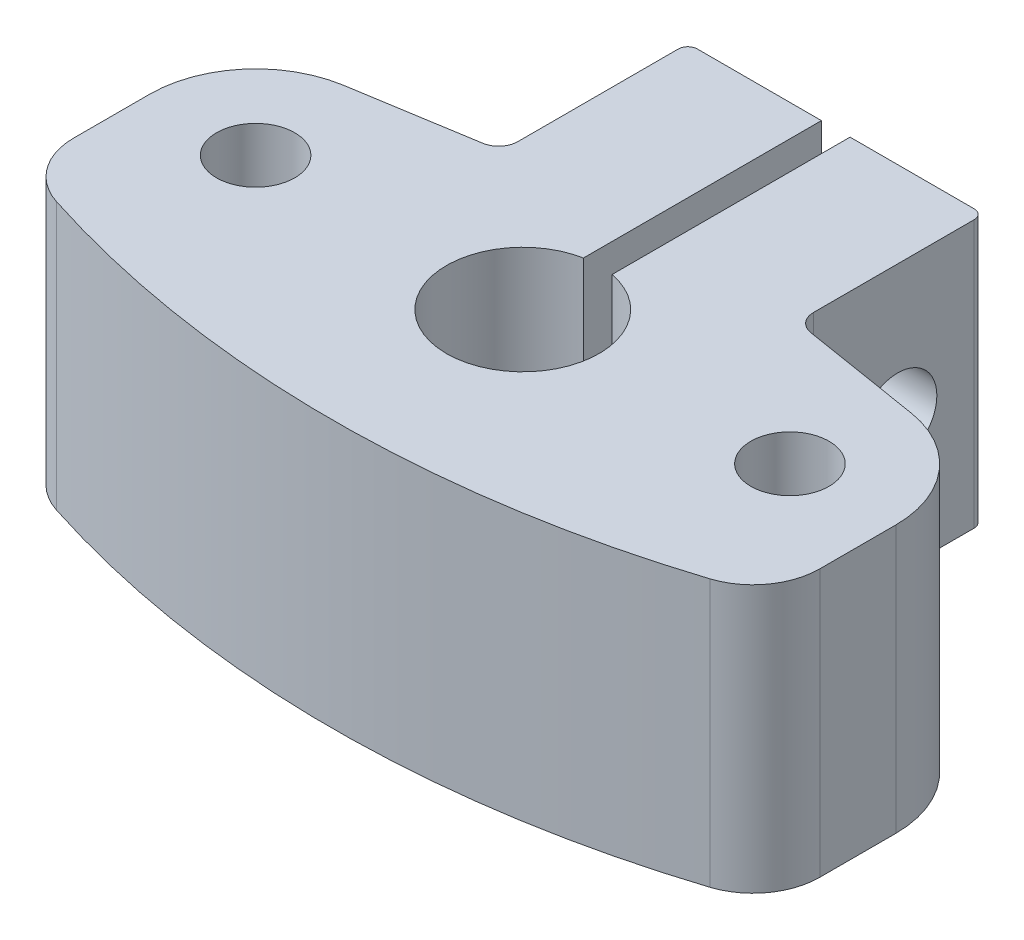
ISO-10303-21;
HEADER;
FILE_DESCRIPTION(('STEP AP214'),'2;1');
FILE_NAME('part.step','',(''),(''),'','','');
FILE_SCHEMA(('AUTOMOTIVE_DESIGN { 1 0 10303 214 1 1 1 1 }'));
ENDSEC;
DATA;
#1=APPLICATION_CONTEXT('core data for automotive mechanical design processes');
#2=APPLICATION_PROTOCOL_DEFINITION('international standard','automotive_design',2000,#1);
#3=PRODUCT_CONTEXT('',#1,'mechanical');
#4=PRODUCT('Part','Part','',(#3));
#5=PRODUCT_RELATED_PRODUCT_CATEGORY('part','',(#4));
#6=PRODUCT_DEFINITION_FORMATION('','',#4);
#7=PRODUCT_DEFINITION_CONTEXT('part definition',#1,'design');
#8=PRODUCT_DEFINITION('design','',#6,#7);
#9=PRODUCT_DEFINITION_SHAPE('','',#8);
#10=(LENGTH_UNIT() NAMED_UNIT(*) SI_UNIT(.MILLI.,.METRE.));
#11=(NAMED_UNIT(*) PLANE_ANGLE_UNIT() SI_UNIT($,.RADIAN.));
#12=(NAMED_UNIT(*) SI_UNIT($,.STERADIAN.) SOLID_ANGLE_UNIT());
#13=UNCERTAINTY_MEASURE_WITH_UNIT(LENGTH_MEASURE(1.E-05),#10,'distance_accuracy_value','');
#14=(GEOMETRIC_REPRESENTATION_CONTEXT(3) GLOBAL_UNCERTAINTY_ASSIGNED_CONTEXT((#13)) GLOBAL_UNIT_ASSIGNED_CONTEXT((#10,
#11,#12)) REPRESENTATION_CONTEXT('',''));
#15=CARTESIAN_POINT('',(0.,0.,0.));
#16=DIRECTION('',(0.,0.,1.));
#17=DIRECTION('',(1.,0.,0.));
#18=AXIS2_PLACEMENT_3D('',#15,#16,#17);
#19=CARTESIAN_POINT('',(-14.,14.,0.));
#20=DIRECTION('',(0.,1.,0.));
#21=DIRECTION('',(0.,0.,1.));
#22=AXIS2_PLACEMENT_3D('',#19,#20,#21);
#23=PLANE('',#22);
#24=CARTESIAN_POINT('',(-14.,14.,0.));
#25=DIRECTION('',(0.,1.,0.));
#26=DIRECTION('',(0.,0.,1.));
#27=AXIS2_PLACEMENT_3D('',#24,#25,#26);
#28=CIRCLE('',#27,2.05);
#29=CARTESIAN_POINT('',(-14.,14.,2.05));
#30=VERTEX_POINT('',#29);
#31=EDGE_CURVE('E207',#30,#30,#28,.T.);
#32=ORIENTED_EDGE('',*,*,#31,.F.);
#33=EDGE_LOOP('',(#32));
#34=FACE_BOUND('',#33,.T.);
#35=CARTESIAN_POINT('',(-14.,14.,0.));
#36=DIRECTION('',(0.,1.,0.));
#37=DIRECTION('',(0.,0.,1.));
#38=AXIS2_PLACEMENT_3D('',#35,#36,#37);
#39=CIRCLE('',#38,5.55);
#40=CARTESIAN_POINT('',(-14.8885534853354,14.,-5.47840968746391));
#41=VERTEX_POINT('',#40);
#42=CARTESIAN_POINT('',(-19.55,14.,0.));
#43=VERTEX_POINT('',#42);
#44=EDGE_CURVE('E242',#41,#43,#39,.T.);
#45=ORIENTED_EDGE('',*,*,#44,.T.);
#46=DIRECTION('',(0.,0.,1.));
#47=VECTOR('',#46,1.);
#48=CARTESIAN_POINT('',(-19.55,14.,0.));
#49=LINE('',#48,#47);
#50=CARTESIAN_POINT('',(-19.55,14.,3.98647317024878));
#51=VERTEX_POINT('',#50);
#52=EDGE_CURVE('E130',#43,#51,#49,.T.);
#53=ORIENTED_EDGE('',*,*,#52,.T.);
#54=CARTESIAN_POINT('',(-16.05,14.,3.98647317024878));
#55=DIRECTION('',(0.,1.,0.));
#56=DIRECTION('',(0.,0.,1.));
#57=AXIS2_PLACEMENT_3D('',#54,#55,#56);
#58=CIRCLE('',#57,3.5);
#59=CARTESIAN_POINT('',(-17.12,14.,7.31890471493203));
#60=VERTEX_POINT('',#59);
#61=EDGE_CURVE('E294',#51,#60,#58,.T.);
#62=ORIENTED_EDGE('',*,*,#61,.T.);
#63=CARTESIAN_POINT('',(0.,14.,-46.));
#64=DIRECTION('',(0.,1.,0.));
#65=DIRECTION('',(0.,0.,1.));
#66=AXIS2_PLACEMENT_3D('',#63,#64,#65);
#67=CIRCLE('',#66,56.);
#68=CARTESIAN_POINT('',(17.12,14.,7.31890471493202));
#69=VERTEX_POINT('',#68);
#70=EDGE_CURVE('E313',#60,#69,#67,.T.);
#71=ORIENTED_EDGE('',*,*,#70,.T.);
#72=CARTESIAN_POINT('',(16.05,14.,3.98647317024878));
#73=DIRECTION('',(0.,1.,0.));
#74=DIRECTION('',(0.,0.,-1.));
#75=AXIS2_PLACEMENT_3D('',#72,#73,#74);
#76=CIRCLE('',#75,3.5);
#77=CARTESIAN_POINT('',(19.55,14.,3.98647317024878));
#78=VERTEX_POINT('',#77);
#79=EDGE_CURVE('E310',#69,#78,#76,.T.);
#80=ORIENTED_EDGE('',*,*,#79,.T.);
#81=DIRECTION('',(0.,0.,-1.));
#82=VECTOR('',#81,1.);
#83=CARTESIAN_POINT('',(19.55,14.,0.));
#84=LINE('',#83,#82);
#85=CARTESIAN_POINT('',(19.55,14.,0.));
#86=VERTEX_POINT('',#85);
#87=EDGE_CURVE('E312',#78,#86,#84,.T.);
#88=ORIENTED_EDGE('',*,*,#87,.T.);
#89=CARTESIAN_POINT('',(14.,14.,0.));
#90=DIRECTION('',(0.,1.,0.));
#91=DIRECTION('',(0.,0.,1.));
#92=AXIS2_PLACEMENT_3D('',#89,#90,#91);
#93=CIRCLE('',#92,5.55);
#94=CARTESIAN_POINT('',(14.8885534853354,14.,-5.47840968746391));
#95=VERTEX_POINT('',#94);
#96=EDGE_CURVE('E315',#86,#95,#93,.T.);
#97=ORIENTED_EDGE('',*,*,#96,.T.);
#98=DIRECTION('',(-0.987100844588092,0.,-0.160099727087451));
#99=VECTOR('',#98,1.);
#100=CARTESIAN_POINT('',(14.8885534853354,14.,-5.47840968746391));
#101=LINE('',#100,#99);
#102=CARTESIAN_POINT('',(8.58990027291255,14.,-6.5));
#103=VERTEX_POINT('',#102);
#104=EDGE_CURVE('E321',#95,#103,#101,.T.);
#105=ORIENTED_EDGE('',*,*,#104,.T.);
#106=CARTESIAN_POINT('',(8.75,14.,-7.48710084458809));
#107=DIRECTION('',(0.,-1.,0.));
#108=DIRECTION('',(0.,0.,1.));
#109=AXIS2_PLACEMENT_3D('',#106,#107,#108);
#110=CIRCLE('',#109,1.);
#111=CARTESIAN_POINT('',(7.75,14.,-7.48710084458809));
#112=VERTEX_POINT('',#111);
#113=EDGE_CURVE('E323',#103,#112,#110,.T.);
#114=ORIENTED_EDGE('',*,*,#113,.T.);
#115=DIRECTION('',(0.,0.,-1.));
#116=VECTOR('',#115,1.);
#117=CARTESIAN_POINT('',(7.75,14.,-7.48710084458809));
#118=LINE('',#117,#116);
#119=CARTESIAN_POINT('',(7.75,14.,-15.9));
#120=VERTEX_POINT('',#119);
#121=EDGE_CURVE('E325',#112,#120,#118,.T.);
#122=ORIENTED_EDGE('',*,*,#121,.T.);
#123=CARTESIAN_POINT('',(7.25,14.,-15.9));
#124=DIRECTION('',(0.,1.,0.));
#125=DIRECTION('',(0.,0.,1.));
#126=AXIS2_PLACEMENT_3D('',#123,#124,#125);
#127=CIRCLE('',#126,0.5);
#128=CARTESIAN_POINT('',(7.25,14.,-16.4));
#129=VERTEX_POINT('',#128);
#130=EDGE_CURVE('E327',#120,#129,#127,.T.);
#131=ORIENTED_EDGE('',*,*,#130,.T.);
#132=DIRECTION('',(-1.,0.,0.));
#133=VECTOR('',#132,1.);
#134=CARTESIAN_POINT('',(0.75,14.,-16.4));
#135=LINE('',#134,#133);
#136=CARTESIAN_POINT('',(0.75,14.,-16.4));
#137=VERTEX_POINT('',#136);
#138=EDGE_CURVE('E329',#129,#137,#135,.T.);
#139=ORIENTED_EDGE('',*,*,#138,.T.);
#140=DIRECTION('',(0.,0.,1.));
#141=VECTOR('',#140,1.);
#142=CARTESIAN_POINT('',(0.75,14.,-3.92905841137543));
#143=LINE('',#142,#141);
#144=CARTESIAN_POINT('',(0.75,14.,-3.92905841137543));
#145=VERTEX_POINT('',#144);
#146=EDGE_CURVE('E331',#137,#145,#143,.T.);
#147=ORIENTED_EDGE('',*,*,#146,.T.);
#148=CARTESIAN_POINT('',(0.,14.,0.));
#149=DIRECTION('',(0.,-1.,0.));
#150=DIRECTION('',(0.,0.,1.));
#151=AXIS2_PLACEMENT_3D('',#148,#149,#150);
#152=CIRCLE('',#151,4.);
#153=CARTESIAN_POINT('',(-0.749999999999998,14.,-3.92905841137543));
#154=VERTEX_POINT('',#153);
#155=EDGE_CURVE('E333',#145,#154,#152,.T.);
#156=ORIENTED_EDGE('',*,*,#155,.T.);
#157=DIRECTION('',(0.,0.,-1.));
#158=VECTOR('',#157,1.);
#159=CARTESIAN_POINT('',(-0.75,14.,-3.92905841137543));
#160=LINE('',#159,#158);
#161=CARTESIAN_POINT('',(-0.75,14.,-16.4));
#162=VERTEX_POINT('',#161);
#163=EDGE_CURVE('E335',#154,#162,#160,.T.);
#164=ORIENTED_EDGE('',*,*,#163,.T.);
#165=DIRECTION('',(-1.,0.,0.));
#166=VECTOR('',#165,1.);
#167=CARTESIAN_POINT('',(-7.25,14.,-16.4));
#168=LINE('',#167,#166);
#169=CARTESIAN_POINT('',(-7.25,14.,-16.4));
#170=VERTEX_POINT('',#169);
#171=EDGE_CURVE('E337',#162,#170,#168,.T.);
#172=ORIENTED_EDGE('',*,*,#171,.T.);
#173=CARTESIAN_POINT('',(-7.25,14.,-15.9));
#174=DIRECTION('',(0.,1.,0.));
#175=DIRECTION('',(0.,0.,1.));
#176=AXIS2_PLACEMENT_3D('',#173,#174,#175);
#177=CIRCLE('',#176,0.5);
#178=CARTESIAN_POINT('',(-7.75,14.,-15.9));
#179=VERTEX_POINT('',#178);
#180=EDGE_CURVE('E185',#170,#179,#177,.T.);
#181=ORIENTED_EDGE('',*,*,#180,.T.);
#182=DIRECTION('',(0.,0.,1.));
#183=VECTOR('',#182,1.);
#184=CARTESIAN_POINT('',(-7.75,14.,-7.48710084458809));
#185=LINE('',#184,#183);
#186=CARTESIAN_POINT('',(-7.75,14.,-7.48710084458809));
#187=VERTEX_POINT('',#186);
#188=EDGE_CURVE('E179',#179,#187,#185,.T.);
#189=ORIENTED_EDGE('',*,*,#188,.T.);
#190=CARTESIAN_POINT('',(-8.75,14.,-7.48710084458809));
#191=DIRECTION('',(0.,-1.,0.));
#192=DIRECTION('',(0.,0.,-1.));
#193=AXIS2_PLACEMENT_3D('',#190,#191,#192);
#194=CIRCLE('',#193,1.);
#195=CARTESIAN_POINT('',(-8.58990027291255,14.,-6.5));
#196=VERTEX_POINT('',#195);
#197=EDGE_CURVE('E183',#187,#196,#194,.T.);
#198=ORIENTED_EDGE('',*,*,#197,.T.);
#199=DIRECTION('',(-0.987100844588092,0.,0.160099727087451));
#200=VECTOR('',#199,1.);
#201=CARTESIAN_POINT('',(-14.8885534853354,14.,-5.47840968746391));
#202=LINE('',#201,#200);
#203=EDGE_CURVE('E51',#196,#41,#202,.T.);
#204=ORIENTED_EDGE('',*,*,#203,.T.);
#205=EDGE_LOOP('',(#45,#53,#62,#71,#80,#88,#97,#105,#114,#122,#131,#139,#147,#156,#164,#172,
#181,#189,#198,#204));
#206=FACE_BOUND('',#205,.T.);
#207=CARTESIAN_POINT('',(14.,14.,0.));
#208=DIRECTION('',(0.,1.,0.));
#209=DIRECTION('',(0.,0.,1.));
#210=AXIS2_PLACEMENT_3D('',#207,#208,#209);
#211=CIRCLE('',#210,2.05);
#212=CARTESIAN_POINT('',(14.,14.,2.05));
#213=VERTEX_POINT('',#212);
#214=EDGE_CURVE('E395',#213,#213,#211,.T.);
#215=ORIENTED_EDGE('',*,*,#214,.F.);
#216=EDGE_LOOP('',(#215));
#217=FACE_BOUND('',#216,.T.);
#218=ADVANCED_FACE('F33',(#34,#206,#217),#23,.T.);
#219=CARTESIAN_POINT('',(-14.,0.,0.));
#220=DIRECTION('',(0.,1.,0.));
#221=DIRECTION('',(0.,0.,1.));
#222=AXIS2_PLACEMENT_3D('',#219,#220,#221);
#223=PLANE('',#222);
#224=CARTESIAN_POINT('',(-14.,0.,0.));
#225=DIRECTION('',(0.,1.,0.));
#226=DIRECTION('',(0.,0.,1.));
#227=AXIS2_PLACEMENT_3D('',#224,#225,#226);
#228=CIRCLE('',#227,5.55);
#229=CARTESIAN_POINT('',(-14.8885534853354,0.,-5.47840968746391));
#230=VERTEX_POINT('',#229);
#231=CARTESIAN_POINT('',(-19.55,0.,0.));
#232=VERTEX_POINT('',#231);
#233=EDGE_CURVE('E203',#230,#232,#228,.T.);
#234=ORIENTED_EDGE('',*,*,#233,.F.);
#235=DIRECTION('',(-0.987100844588092,0.,0.160099727087451));
#236=VECTOR('',#235,1.);
#237=CARTESIAN_POINT('',(-14.8885534853354,0.,-5.47840968746391));
#238=LINE('',#237,#236);
#239=CARTESIAN_POINT('',(-8.58990027291255,0.,-6.5));
#240=VERTEX_POINT('',#239);
#241=EDGE_CURVE('E122',#240,#230,#238,.T.);
#242=ORIENTED_EDGE('',*,*,#241,.F.);
#243=CARTESIAN_POINT('',(-8.75,0.,-7.48710084458809));
#244=DIRECTION('',(0.,-1.,0.));
#245=DIRECTION('',(0.,0.,-1.));
#246=AXIS2_PLACEMENT_3D('',#243,#244,#245);
#247=CIRCLE('',#246,1.);
#248=CARTESIAN_POINT('',(-7.75,0.,-7.48710084458809));
#249=VERTEX_POINT('',#248);
#250=EDGE_CURVE('E116',#249,#240,#247,.T.);
#251=ORIENTED_EDGE('',*,*,#250,.F.);
#252=DIRECTION('',(0.,0.,1.));
#253=VECTOR('',#252,1.);
#254=CARTESIAN_POINT('',(-7.75,0.,-7.48710084458809));
#255=LINE('',#254,#253);
#256=CARTESIAN_POINT('',(-7.75,0.,-15.9));
#257=VERTEX_POINT('',#256);
#258=EDGE_CURVE('E193',#257,#249,#255,.T.);
#259=ORIENTED_EDGE('',*,*,#258,.F.);
#260=CARTESIAN_POINT('',(-7.25,0.,-15.9));
#261=DIRECTION('',(0.,1.,0.));
#262=DIRECTION('',(0.,0.,1.));
#263=AXIS2_PLACEMENT_3D('',#260,#261,#262);
#264=CIRCLE('',#263,0.5);
#265=CARTESIAN_POINT('',(-7.25,0.,-16.4));
#266=VERTEX_POINT('',#265);
#267=EDGE_CURVE('E237',#266,#257,#264,.T.);
#268=ORIENTED_EDGE('',*,*,#267,.F.);
#269=DIRECTION('',(-1.,0.,0.));
#270=VECTOR('',#269,1.);
#271=CARTESIAN_POINT('',(-7.25,0.,-16.4));
#272=LINE('',#271,#270);
#273=CARTESIAN_POINT('',(-0.75,0.,-16.4));
#274=VERTEX_POINT('',#273);
#275=EDGE_CURVE('E235',#274,#266,#272,.T.);
#276=ORIENTED_EDGE('',*,*,#275,.F.);
#277=DIRECTION('',(0.,0.,-1.));
#278=VECTOR('',#277,1.);
#279=CARTESIAN_POINT('',(-0.75,0.,-3.92905841137543));
#280=LINE('',#279,#278);
#281=CARTESIAN_POINT('',(-0.749999999999998,0.,-3.92905841137543));
#282=VERTEX_POINT('',#281);
#283=EDGE_CURVE('E233',#282,#274,#280,.T.);
#284=ORIENTED_EDGE('',*,*,#283,.F.);
#285=CARTESIAN_POINT('',(0.,0.,0.));
#286=DIRECTION('',(0.,-1.,0.));
#287=DIRECTION('',(0.,0.,1.));
#288=AXIS2_PLACEMENT_3D('',#285,#286,#287);
#289=CIRCLE('',#288,4.);
#290=CARTESIAN_POINT('',(0.75,0.,-3.92905841137543));
#291=VERTEX_POINT('',#290);
#292=EDGE_CURVE('E231',#291,#282,#289,.T.);
#293=ORIENTED_EDGE('',*,*,#292,.F.);
#294=DIRECTION('',(0.,0.,1.));
#295=VECTOR('',#294,1.);
#296=CARTESIAN_POINT('',(0.75,0.,-3.92905841137543));
#297=LINE('',#296,#295);
#298=CARTESIAN_POINT('',(0.75,0.,-16.4));
#299=VERTEX_POINT('',#298);
#300=EDGE_CURVE('E229',#299,#291,#297,.T.);
#301=ORIENTED_EDGE('',*,*,#300,.F.);
#302=DIRECTION('',(-1.,0.,0.));
#303=VECTOR('',#302,1.);
#304=CARTESIAN_POINT('',(0.75,0.,-16.4));
#305=LINE('',#304,#303);
#306=CARTESIAN_POINT('',(7.25,0.,-16.4));
#307=VERTEX_POINT('',#306);
#308=EDGE_CURVE('E227',#307,#299,#305,.T.);
#309=ORIENTED_EDGE('',*,*,#308,.F.);
#310=CARTESIAN_POINT('',(7.25,0.,-15.9));
#311=DIRECTION('',(0.,1.,0.));
#312=DIRECTION('',(0.,0.,1.));
#313=AXIS2_PLACEMENT_3D('',#310,#311,#312);
#314=CIRCLE('',#313,0.5);
#315=CARTESIAN_POINT('',(7.75,0.,-15.9));
#316=VERTEX_POINT('',#315);
#317=EDGE_CURVE('E225',#316,#307,#314,.T.);
#318=ORIENTED_EDGE('',*,*,#317,.F.);
#319=DIRECTION('',(0.,0.,-1.));
#320=VECTOR('',#319,1.);
#321=CARTESIAN_POINT('',(7.75,0.,-7.48710084458809));
#322=LINE('',#321,#320);
#323=CARTESIAN_POINT('',(7.75,0.,-7.48710084458809));
#324=VERTEX_POINT('',#323);
#325=EDGE_CURVE('E223',#324,#316,#322,.T.);
#326=ORIENTED_EDGE('',*,*,#325,.F.);
#327=CARTESIAN_POINT('',(8.75,0.,-7.48710084458809));
#328=DIRECTION('',(0.,-1.,0.));
#329=DIRECTION('',(0.,0.,1.));
#330=AXIS2_PLACEMENT_3D('',#327,#328,#329);
#331=CIRCLE('',#330,1.);
#332=CARTESIAN_POINT('',(8.58990027291255,0.,-6.5));
#333=VERTEX_POINT('',#332);
#334=EDGE_CURVE('E221',#333,#324,#331,.T.);
#335=ORIENTED_EDGE('',*,*,#334,.F.);
#336=DIRECTION('',(-0.987100844588092,0.,-0.160099727087451));
#337=VECTOR('',#336,1.);
#338=CARTESIAN_POINT('',(14.8885534853354,0.,-5.47840968746391));
#339=LINE('',#338,#337);
#340=CARTESIAN_POINT('',(14.8885534853354,0.,-5.47840968746391));
#341=VERTEX_POINT('',#340);
#342=EDGE_CURVE('E219',#341,#333,#339,.T.);
#343=ORIENTED_EDGE('',*,*,#342,.F.);
#344=CARTESIAN_POINT('',(14.,0.,0.));
#345=DIRECTION('',(0.,1.,0.));
#346=DIRECTION('',(0.,0.,1.));
#347=AXIS2_PLACEMENT_3D('',#344,#345,#346);
#348=CIRCLE('',#347,5.55);
#349=CARTESIAN_POINT('',(19.55,0.,0.));
#350=VERTEX_POINT('',#349);
#351=EDGE_CURVE('E217',#350,#341,#348,.T.);
#352=ORIENTED_EDGE('',*,*,#351,.F.);
#353=DIRECTION('',(0.,0.,-1.));
#354=VECTOR('',#353,1.);
#355=CARTESIAN_POINT('',(19.55,0.,0.));
#356=LINE('',#355,#354);
#357=CARTESIAN_POINT('',(19.55,0.,3.98647317024878));
#358=VERTEX_POINT('',#357);
#359=EDGE_CURVE('E215',#358,#350,#356,.T.);
#360=ORIENTED_EDGE('',*,*,#359,.F.);
#361=CARTESIAN_POINT('',(16.05,0.,3.98647317024878));
#362=DIRECTION('',(0.,1.,0.));
#363=DIRECTION('',(0.,0.,-1.));
#364=AXIS2_PLACEMENT_3D('',#361,#362,#363);
#365=CIRCLE('',#364,3.5);
#366=CARTESIAN_POINT('',(17.12,0.,7.31890471493202));
#367=VERTEX_POINT('',#366);
#368=EDGE_CURVE('E213',#367,#358,#365,.T.);
#369=ORIENTED_EDGE('',*,*,#368,.F.);
#370=CARTESIAN_POINT('',(0.,0.,-46.));
#371=DIRECTION('',(0.,1.,0.));
#372=DIRECTION('',(0.,0.,1.));
#373=AXIS2_PLACEMENT_3D('',#370,#371,#372);
#374=CIRCLE('',#373,56.);
#375=CARTESIAN_POINT('',(-17.12,0.,7.31890471493203));
#376=VERTEX_POINT('',#375);
#377=EDGE_CURVE('E211',#376,#367,#374,.T.);
#378=ORIENTED_EDGE('',*,*,#377,.F.);
#379=CARTESIAN_POINT('',(-16.05,0.,3.98647317024878));
#380=DIRECTION('',(0.,1.,0.));
#381=DIRECTION('',(0.,0.,1.));
#382=AXIS2_PLACEMENT_3D('',#379,#380,#381);
#383=CIRCLE('',#382,3.5);
#384=CARTESIAN_POINT('',(-19.55,0.,3.98647317024878));
#385=VERTEX_POINT('',#384);
#386=EDGE_CURVE('E209',#385,#376,#383,.T.);
#387=ORIENTED_EDGE('',*,*,#386,.F.);
#388=DIRECTION('',(0.,0.,1.));
#389=VECTOR('',#388,1.);
#390=CARTESIAN_POINT('',(-19.55,0.,0.));
#391=LINE('',#390,#389);
#392=EDGE_CURVE('E206',#232,#385,#391,.T.);
#393=ORIENTED_EDGE('',*,*,#392,.F.);
#394=EDGE_LOOP('',(#234,#242,#251,#259,#268,#276,#284,#293,#301,#309,#318,#326,#335,#343,#352,
#360,#369,#378,#387,#393));
#395=FACE_BOUND('',#394,.T.);
#396=CARTESIAN_POINT('',(-14.,0.,0.));
#397=DIRECTION('',(0.,1.,0.));
#398=DIRECTION('',(0.,0.,1.));
#399=AXIS2_PLACEMENT_3D('',#396,#397,#398);
#400=CIRCLE('',#399,2.05);
#401=CARTESIAN_POINT('',(-14.,0.,2.05));
#402=VERTEX_POINT('',#401);
#403=EDGE_CURVE('E402',#402,#402,#400,.T.);
#404=ORIENTED_EDGE('',*,*,#403,.T.);
#405=EDGE_LOOP('',(#404));
#406=FACE_BOUND('',#405,.T.);
#407=CARTESIAN_POINT('',(14.,0.,0.));
#408=DIRECTION('',(0.,1.,0.));
#409=DIRECTION('',(0.,0.,1.));
#410=AXIS2_PLACEMENT_3D('',#407,#408,#409);
#411=CIRCLE('',#410,2.05);
#412=CARTESIAN_POINT('',(14.,0.,2.05));
#413=VERTEX_POINT('',#412);
#414=EDGE_CURVE('E391',#413,#413,#411,.T.);
#415=ORIENTED_EDGE('',*,*,#414,.T.);
#416=EDGE_LOOP('',(#415));
#417=FACE_BOUND('',#416,.T.);
#418=ADVANCED_FACE('F298',(#395,#406,#417),#223,.F.);
#419=CARTESIAN_POINT('',(-14.,14.,0.));
#420=DIRECTION('',(0.,-1.,0.));
#421=DIRECTION('',(0.,0.,-1.));
#422=AXIS2_PLACEMENT_3D('',#419,#420,#421);
#423=CYLINDRICAL_SURFACE('',#422,5.55);
#424=ORIENTED_EDGE('',*,*,#233,.T.);
#425=DIRECTION('',(0.,-1.,0.));
#426=VECTOR('',#425,1.);
#427=CARTESIAN_POINT('',(-19.55,14.,0.));
#428=LINE('',#427,#426);
#429=EDGE_CURVE('E11',#43,#232,#428,.T.);
#430=ORIENTED_EDGE('',*,*,#429,.F.);
#431=ORIENTED_EDGE('',*,*,#44,.F.);
#432=DIRECTION('',(0.,-1.,0.));
#433=VECTOR('',#432,1.);
#434=CARTESIAN_POINT('',(-14.8885534853354,14.,-5.47840968746391));
#435=LINE('',#434,#433);
#436=EDGE_CURVE('E199',#41,#230,#435,.T.);
#437=ORIENTED_EDGE('',*,*,#436,.T.);
#438=EDGE_LOOP('',(#424,#430,#431,#437));
#439=FACE_BOUND('',#438,.T.);
#440=ADVANCED_FACE('F35',(#439),#423,.T.);
#441=CARTESIAN_POINT('',(-19.55,14.,0.));
#442=DIRECTION('',(1.,0.,0.));
#443=DIRECTION('',(0.,0.,-1.));
#444=AXIS2_PLACEMENT_3D('',#441,#442,#443);
#445=PLANE('',#444);
#446=ORIENTED_EDGE('',*,*,#392,.T.);
#447=DIRECTION('',(0.,-1.,0.));
#448=VECTOR('',#447,1.);
#449=CARTESIAN_POINT('',(-19.55,14.,3.98647317024878));
#450=LINE('',#449,#448);
#451=EDGE_CURVE('E43',#51,#385,#450,.T.);
#452=ORIENTED_EDGE('',*,*,#451,.F.);
#453=ORIENTED_EDGE('',*,*,#52,.F.);
#454=ORIENTED_EDGE('',*,*,#429,.T.);
#455=EDGE_LOOP('',(#446,#452,#453,#454));
#456=FACE_BOUND('',#455,.T.);
#457=ADVANCED_FACE('F482',(#456),#445,.F.);
#458=CARTESIAN_POINT('',(-16.05,14.,3.98647317024878));
#459=DIRECTION('',(0.,-1.,0.));
#460=DIRECTION('',(0.,0.,-1.));
#461=AXIS2_PLACEMENT_3D('',#458,#459,#460);
#462=CYLINDRICAL_SURFACE('',#461,3.5);
#463=ORIENTED_EDGE('',*,*,#386,.T.);
#464=DIRECTION('',(0.,-1.,0.));
#465=VECTOR('',#464,1.);
#466=CARTESIAN_POINT('',(-17.12,14.,7.31890471493203));
#467=LINE('',#466,#465);
#468=EDGE_CURVE('E285',#60,#376,#467,.T.);
#469=ORIENTED_EDGE('',*,*,#468,.F.);
#470=ORIENTED_EDGE('',*,*,#61,.F.);
#471=ORIENTED_EDGE('',*,*,#451,.T.);
#472=EDGE_LOOP('',(#463,#469,#470,#471));
#473=FACE_BOUND('',#472,.T.);
#474=ADVANCED_FACE('F292',(#473),#462,.T.);
#475=CARTESIAN_POINT('',(0.,14.,-46.));
#476=DIRECTION('',(0.,-1.,0.));
#477=DIRECTION('',(0.,0.,-1.));
#478=AXIS2_PLACEMENT_3D('',#475,#476,#477);
#479=CYLINDRICAL_SURFACE('',#478,56.);
#480=ORIENTED_EDGE('',*,*,#377,.T.);
#481=DIRECTION('',(0.,-1.,0.));
#482=VECTOR('',#481,1.);
#483=CARTESIAN_POINT('',(17.12,14.,7.31890471493202));
#484=LINE('',#483,#482);
#485=EDGE_CURVE('E282',#69,#367,#484,.T.);
#486=ORIENTED_EDGE('',*,*,#485,.F.);
#487=ORIENTED_EDGE('',*,*,#70,.F.);
#488=ORIENTED_EDGE('',*,*,#468,.T.);
#489=EDGE_LOOP('',(#480,#486,#487,#488));
#490=FACE_BOUND('',#489,.T.);
#491=ADVANCED_FACE('F304',(#490),#479,.T.);
#492=CARTESIAN_POINT('',(16.05,14.,3.98647317024878));
#493=DIRECTION('',(0.,-1.,0.));
#494=DIRECTION('',(0.,0.,-1.));
#495=AXIS2_PLACEMENT_3D('',#492,#493,#494);
#496=CYLINDRICAL_SURFACE('',#495,3.5);
#497=ORIENTED_EDGE('',*,*,#368,.T.);
#498=DIRECTION('',(0.,-1.,0.));
#499=VECTOR('',#498,1.);
#500=CARTESIAN_POINT('',(19.55,14.,3.98647317024878));
#501=LINE('',#500,#499);
#502=EDGE_CURVE('E279',#78,#358,#501,.T.);
#503=ORIENTED_EDGE('',*,*,#502,.F.);
#504=ORIENTED_EDGE('',*,*,#79,.F.);
#505=ORIENTED_EDGE('',*,*,#485,.T.);
#506=EDGE_LOOP('',(#497,#503,#504,#505));
#507=FACE_BOUND('',#506,.T.);
#508=ADVANCED_FACE('F308',(#507),#496,.T.);
#509=CARTESIAN_POINT('',(19.55,14.,0.));
#510=DIRECTION('',(-1.,0.,0.));
#511=DIRECTION('',(0.,0.,1.));
#512=AXIS2_PLACEMENT_3D('',#509,#510,#511);
#513=PLANE('',#512);
#514=ORIENTED_EDGE('',*,*,#359,.T.);
#515=DIRECTION('',(0.,-1.,0.));
#516=VECTOR('',#515,1.);
#517=CARTESIAN_POINT('',(19.55,14.,0.));
#518=LINE('',#517,#516);
#519=EDGE_CURVE('E276',#86,#350,#518,.T.);
#520=ORIENTED_EDGE('',*,*,#519,.F.);
#521=ORIENTED_EDGE('',*,*,#87,.F.);
#522=ORIENTED_EDGE('',*,*,#502,.T.);
#523=EDGE_LOOP('',(#514,#520,#521,#522));
#524=FACE_BOUND('',#523,.T.);
#525=ADVANCED_FACE('F468',(#524),#513,.F.);
#526=CARTESIAN_POINT('',(14.,14.,0.));
#527=DIRECTION('',(0.,-1.,0.));
#528=DIRECTION('',(0.,0.,-1.));
#529=AXIS2_PLACEMENT_3D('',#526,#527,#528);
#530=CYLINDRICAL_SURFACE('',#529,5.55);
#531=ORIENTED_EDGE('',*,*,#351,.T.);
#532=DIRECTION('',(0.,-1.,0.));
#533=VECTOR('',#532,1.);
#534=CARTESIAN_POINT('',(14.8885534853354,14.,-5.47840968746391));
#535=LINE('',#534,#533);
#536=EDGE_CURVE('E273',#95,#341,#535,.T.);
#537=ORIENTED_EDGE('',*,*,#536,.F.);
#538=ORIENTED_EDGE('',*,*,#96,.F.);
#539=ORIENTED_EDGE('',*,*,#519,.T.);
#540=EDGE_LOOP('',(#531,#537,#538,#539));
#541=FACE_BOUND('',#540,.T.);
#542=ADVANCED_FACE('F465',(#541),#530,.T.);
#543=CARTESIAN_POINT('',(14.8885534853354,14.,-5.47840968746391));
#544=DIRECTION('',(-0.160099727087451,0.,0.987100844588092));
#545=DIRECTION('',(0.987100844588092,0.,0.160099727087451));
#546=AXIS2_PLACEMENT_3D('',#543,#544,#545);
#547=PLANE('',#546);
#548=ORIENTED_EDGE('',*,*,#342,.T.);
#549=DIRECTION('',(0.,-1.,0.));
#550=VECTOR('',#549,1.);
#551=CARTESIAN_POINT('',(8.58990027291255,14.,-6.5));
#552=LINE('',#551,#550);
#553=EDGE_CURVE('E270',#103,#333,#552,.T.);
#554=ORIENTED_EDGE('',*,*,#553,.F.);
#555=ORIENTED_EDGE('',*,*,#104,.F.);
#556=ORIENTED_EDGE('',*,*,#536,.T.);
#557=EDGE_LOOP('',(#548,#554,#555,#556));
#558=FACE_BOUND('',#557,.T.);
#559=ADVANCED_FACE('F460',(#558),#547,.F.);
#560=CARTESIAN_POINT('',(8.75,14.,-7.48710084458809));
#561=DIRECTION('',(0.,-1.,0.));
#562=DIRECTION('',(0.,0.,-1.));
#563=AXIS2_PLACEMENT_3D('',#560,#561,#562);
#564=CYLINDRICAL_SURFACE('',#563,1.);
#565=ORIENTED_EDGE('',*,*,#334,.T.);
#566=DIRECTION('',(0.,-1.,0.));
#567=VECTOR('',#566,1.);
#568=CARTESIAN_POINT('',(7.75,14.,-7.48710084458809));
#569=LINE('',#568,#567);
#570=EDGE_CURVE('E267',#112,#324,#569,.T.);
#571=ORIENTED_EDGE('',*,*,#570,.F.);
#572=ORIENTED_EDGE('',*,*,#113,.F.);
#573=ORIENTED_EDGE('',*,*,#553,.T.);
#574=EDGE_LOOP('',(#565,#571,#572,#573));
#575=FACE_BOUND('',#574,.T.);
#576=ADVANCED_FACE('F455',(#575),#564,.F.);
#577=CARTESIAN_POINT('',(7.75,14.,-7.48710084458809));
#578=DIRECTION('',(-1.,0.,0.));
#579=DIRECTION('',(0.,0.,1.));
#580=AXIS2_PLACEMENT_3D('',#577,#578,#579);
#581=PLANE('',#580);
#582=CARTESIAN_POINT('',(7.75,7.,-11.9));
#583=DIRECTION('',(1.,0.,0.));
#584=DIRECTION('',(0.,0.,-1.));
#585=AXIS2_PLACEMENT_3D('',#582,#583,#584);
#586=CIRCLE('',#585,2.05);
#587=CARTESIAN_POINT('',(7.75,7.,-13.95));
#588=VERTEX_POINT('',#587);
#589=EDGE_CURVE('E386',#588,#588,#586,.T.);
#590=ORIENTED_EDGE('',*,*,#589,.F.);
#591=EDGE_LOOP('',(#590));
#592=FACE_BOUND('',#591,.T.);
#593=ORIENTED_EDGE('',*,*,#325,.T.);
#594=DIRECTION('',(0.,-1.,0.));
#595=VECTOR('',#594,1.);
#596=CARTESIAN_POINT('',(7.75,14.,-15.9));
#597=LINE('',#596,#595);
#598=EDGE_CURVE('E264',#120,#316,#597,.T.);
#599=ORIENTED_EDGE('',*,*,#598,.F.);
#600=ORIENTED_EDGE('',*,*,#121,.F.);
#601=ORIENTED_EDGE('',*,*,#570,.T.);
#602=EDGE_LOOP('',(#593,#599,#600,#601));
#603=FACE_BOUND('',#602,.T.);
#604=ADVANCED_FACE('F451',(#592,#603),#581,.F.);
#605=CARTESIAN_POINT('',(7.25,14.,-15.9));
#606=DIRECTION('',(0.,-1.,0.));
#607=DIRECTION('',(0.,0.,-1.));
#608=AXIS2_PLACEMENT_3D('',#605,#606,#607);
#609=CYLINDRICAL_SURFACE('',#608,0.5);
#610=ORIENTED_EDGE('',*,*,#317,.T.);
#611=DIRECTION('',(0.,-1.,0.));
#612=VECTOR('',#611,1.);
#613=CARTESIAN_POINT('',(7.25,14.,-16.4));
#614=LINE('',#613,#612);
#615=EDGE_CURVE('E261',#129,#307,#614,.T.);
#616=ORIENTED_EDGE('',*,*,#615,.F.);
#617=ORIENTED_EDGE('',*,*,#130,.F.);
#618=ORIENTED_EDGE('',*,*,#598,.T.);
#619=EDGE_LOOP('',(#610,#616,#617,#618));
#620=FACE_BOUND('',#619,.T.);
#621=ADVANCED_FACE('F446',(#620),#609,.T.);
#622=CARTESIAN_POINT('',(0.75,14.,-16.4));
#623=DIRECTION('',(0.,0.,1.));
#624=DIRECTION('',(1.,0.,0.));
#625=AXIS2_PLACEMENT_3D('',#622,#623,#624);
#626=PLANE('',#625);
#627=ORIENTED_EDGE('',*,*,#308,.T.);
#628=DIRECTION('',(0.,-1.,0.));
#629=VECTOR('',#628,1.);
#630=CARTESIAN_POINT('',(0.75,14.,-16.4));
#631=LINE('',#630,#629);
#632=EDGE_CURVE('E258',#137,#299,#631,.T.);
#633=ORIENTED_EDGE('',*,*,#632,.F.);
#634=ORIENTED_EDGE('',*,*,#138,.F.);
#635=ORIENTED_EDGE('',*,*,#615,.T.);
#636=EDGE_LOOP('',(#627,#633,#634,#635));
#637=FACE_BOUND('',#636,.T.);
#638=ADVANCED_FACE('F440',(#637),#626,.F.);
#639=CARTESIAN_POINT('',(0.75,14.,-3.92905841137543));
#640=DIRECTION('',(1.,0.,0.));
#641=DIRECTION('',(0.,0.,-1.));
#642=AXIS2_PLACEMENT_3D('',#639,#640,#641);
#643=PLANE('',#642);
#644=CARTESIAN_POINT('',(0.750000000000001,7.,-11.9));
#645=DIRECTION('',(1.,0.,0.));
#646=DIRECTION('',(0.,0.,-1.));
#647=AXIS2_PLACEMENT_3D('',#644,#645,#646);
#648=CIRCLE('',#647,2.05);
#649=CARTESIAN_POINT('',(0.750000000000001,7.,-13.95));
#650=VERTEX_POINT('',#649);
#651=EDGE_CURVE('E389',#650,#650,#648,.T.);
#652=ORIENTED_EDGE('',*,*,#651,.T.);
#653=EDGE_LOOP('',(#652));
#654=FACE_BOUND('',#653,.T.);
#655=ORIENTED_EDGE('',*,*,#300,.T.);
#656=DIRECTION('',(0.,-1.,0.));
#657=VECTOR('',#656,1.);
#658=CARTESIAN_POINT('',(0.75,14.,-3.92905841137543));
#659=LINE('',#658,#657);
#660=EDGE_CURVE('E255',#145,#291,#659,.T.);
#661=ORIENTED_EDGE('',*,*,#660,.F.);
#662=ORIENTED_EDGE('',*,*,#146,.F.);
#663=ORIENTED_EDGE('',*,*,#632,.T.);
#664=EDGE_LOOP('',(#655,#661,#662,#663));
#665=FACE_BOUND('',#664,.T.);
#666=ADVANCED_FACE('F436',(#654,#665),#643,.F.);
#667=CARTESIAN_POINT('',(0.,14.,0.));
#668=DIRECTION('',(0.,-1.,0.));
#669=DIRECTION('',(0.,0.,-1.));
#670=AXIS2_PLACEMENT_3D('',#667,#668,#669);
#671=CYLINDRICAL_SURFACE('',#670,4.);
#672=ORIENTED_EDGE('',*,*,#292,.T.);
#673=DIRECTION('',(0.,-1.,0.));
#674=VECTOR('',#673,1.);
#675=CARTESIAN_POINT('',(-0.749999999999998,14.,-3.92905841137543));
#676=LINE('',#675,#674);
#677=EDGE_CURVE('E252',#154,#282,#676,.T.);
#678=ORIENTED_EDGE('',*,*,#677,.F.);
#679=ORIENTED_EDGE('',*,*,#155,.F.);
#680=ORIENTED_EDGE('',*,*,#660,.T.);
#681=EDGE_LOOP('',(#672,#678,#679,#680));
#682=FACE_BOUND('',#681,.T.);
#683=ADVANCED_FACE('F424',(#682),#671,.F.);
#684=CARTESIAN_POINT('',(-0.75,14.,-3.92905841137543));
#685=DIRECTION('',(-1.,0.,0.));
#686=DIRECTION('',(0.,0.,1.));
#687=AXIS2_PLACEMENT_3D('',#684,#685,#686);
#688=PLANE('',#687);
#689=CARTESIAN_POINT('',(-0.750000000000001,7.,-11.9));
#690=DIRECTION('',(-1.,0.,0.));
#691=DIRECTION('',(0.,0.,1.));
#692=AXIS2_PLACEMENT_3D('',#689,#690,#691);
#693=CIRCLE('',#692,2.05);
#694=CARTESIAN_POINT('',(-0.750000000000001,7.,-9.85));
#695=VERTEX_POINT('',#694);
#696=EDGE_CURVE('E392',#695,#695,#693,.T.);
#697=ORIENTED_EDGE('',*,*,#696,.T.);
#698=EDGE_LOOP('',(#697));
#699=FACE_BOUND('',#698,.T.);
#700=ORIENTED_EDGE('',*,*,#283,.T.);
#701=DIRECTION('',(0.,-1.,0.));
#702=VECTOR('',#701,1.);
#703=CARTESIAN_POINT('',(-0.75,14.,-16.4));
#704=LINE('',#703,#702);
#705=EDGE_CURVE('E249',#162,#274,#704,.T.);
#706=ORIENTED_EDGE('',*,*,#705,.F.);
#707=ORIENTED_EDGE('',*,*,#163,.F.);
#708=ORIENTED_EDGE('',*,*,#677,.T.);
#709=EDGE_LOOP('',(#700,#706,#707,#708));
#710=FACE_BOUND('',#709,.T.);
#711=ADVANCED_FACE('F421',(#699,#710),#688,.F.);
#712=CARTESIAN_POINT('',(-7.25,14.,-16.4));
#713=DIRECTION('',(0.,0.,1.));
#714=DIRECTION('',(1.,0.,0.));
#715=AXIS2_PLACEMENT_3D('',#712,#713,#714);
#716=PLANE('',#715);
#717=ORIENTED_EDGE('',*,*,#275,.T.);
#718=DIRECTION('',(0.,-1.,0.));
#719=VECTOR('',#718,1.);
#720=CARTESIAN_POINT('',(-7.25,14.,-16.4));
#721=LINE('',#720,#719);
#722=EDGE_CURVE('E246',#170,#266,#721,.T.);
#723=ORIENTED_EDGE('',*,*,#722,.F.);
#724=ORIENTED_EDGE('',*,*,#171,.F.);
#725=ORIENTED_EDGE('',*,*,#705,.T.);
#726=EDGE_LOOP('',(#717,#723,#724,#725));
#727=FACE_BOUND('',#726,.T.);
#728=ADVANCED_FACE('F343',(#727),#716,.F.);
#729=CARTESIAN_POINT('',(-7.25,14.,-15.9));
#730=DIRECTION('',(0.,-1.,0.));
#731=DIRECTION('',(0.,0.,-1.));
#732=AXIS2_PLACEMENT_3D('',#729,#730,#731);
#733=CYLINDRICAL_SURFACE('',#732,0.5);
#734=ORIENTED_EDGE('',*,*,#267,.T.);
#735=DIRECTION('',(0.,-1.,0.));
#736=VECTOR('',#735,1.);
#737=CARTESIAN_POINT('',(-7.75,14.,-15.9));
#738=LINE('',#737,#736);
#739=EDGE_CURVE('E194',#179,#257,#738,.T.);
#740=ORIENTED_EDGE('',*,*,#739,.F.);
#741=ORIENTED_EDGE('',*,*,#180,.F.);
#742=ORIENTED_EDGE('',*,*,#722,.T.);
#743=EDGE_LOOP('',(#734,#740,#741,#742));
#744=FACE_BOUND('',#743,.T.);
#745=ADVANCED_FACE('F347',(#744),#733,.T.);
#746=CARTESIAN_POINT('',(-7.75,14.,-7.48710084458809));
#747=DIRECTION('',(1.,0.,0.));
#748=DIRECTION('',(0.,0.,-1.));
#749=AXIS2_PLACEMENT_3D('',#746,#747,#748);
#750=PLANE('',#749);
#751=CARTESIAN_POINT('',(-7.75,7.,-11.9));
#752=DIRECTION('',(1.,0.,0.));
#753=DIRECTION('',(0.,0.,-1.));
#754=AXIS2_PLACEMENT_3D('',#751,#752,#753);
#755=CIRCLE('',#754,2.05);
#756=CARTESIAN_POINT('',(-7.75,7.,-13.95));
#757=VERTEX_POINT('',#756);
#758=EDGE_CURVE('E37',#757,#757,#755,.T.);
#759=ORIENTED_EDGE('',*,*,#758,.T.);
#760=EDGE_LOOP('',(#759));
#761=FACE_BOUND('',#760,.T.);
#762=ORIENTED_EDGE('',*,*,#258,.T.);
#763=DIRECTION('',(0.,-1.,0.));
#764=VECTOR('',#763,1.);
#765=CARTESIAN_POINT('',(-7.75,14.,-7.48710084458809));
#766=LINE('',#765,#764);
#767=EDGE_CURVE('E190',#187,#249,#766,.T.);
#768=ORIENTED_EDGE('',*,*,#767,.F.);
#769=ORIENTED_EDGE('',*,*,#188,.F.);
#770=ORIENTED_EDGE('',*,*,#739,.T.);
#771=EDGE_LOOP('',(#762,#768,#769,#770));
#772=FACE_BOUND('',#771,.T.);
#773=ADVANCED_FACE('F191',(#761,#772),#750,.F.);
#774=CARTESIAN_POINT('',(-8.75,14.,-7.48710084458809));
#775=DIRECTION('',(0.,-1.,0.));
#776=DIRECTION('',(0.,0.,-1.));
#777=AXIS2_PLACEMENT_3D('',#774,#775,#776);
#778=CYLINDRICAL_SURFACE('',#777,1.);
#779=ORIENTED_EDGE('',*,*,#250,.T.);
#780=DIRECTION('',(0.,-1.,0.));
#781=VECTOR('',#780,1.);
#782=CARTESIAN_POINT('',(-8.58990027291255,14.,-6.5));
#783=LINE('',#782,#781);
#784=EDGE_CURVE('E195',#196,#240,#783,.T.);
#785=ORIENTED_EDGE('',*,*,#784,.F.);
#786=ORIENTED_EDGE('',*,*,#197,.F.);
#787=ORIENTED_EDGE('',*,*,#767,.T.);
#788=EDGE_LOOP('',(#779,#785,#786,#787));
#789=FACE_BOUND('',#788,.T.);
#790=ADVANCED_FACE('F197',(#789),#778,.F.);
#791=CARTESIAN_POINT('',(-14.8885534853354,14.,-5.47840968746391));
#792=DIRECTION('',(0.160099727087451,0.,0.987100844588092));
#793=DIRECTION('',(0.987100844588092,0.,-0.160099727087451));
#794=AXIS2_PLACEMENT_3D('',#791,#792,#793);
#795=PLANE('',#794);
#796=ORIENTED_EDGE('',*,*,#241,.T.);
#797=ORIENTED_EDGE('',*,*,#436,.F.);
#798=ORIENTED_EDGE('',*,*,#203,.F.);
#799=ORIENTED_EDGE('',*,*,#784,.T.);
#800=EDGE_LOOP('',(#796,#797,#798,#799));
#801=FACE_BOUND('',#800,.T.);
#802=ADVANCED_FACE('F351',(#801),#795,.F.);
#803=CARTESIAN_POINT('',(-14.,14.,0.));
#804=DIRECTION('',(0.,-1.,0.));
#805=DIRECTION('',(0.,0.,-1.));
#806=AXIS2_PLACEMENT_3D('',#803,#804,#805);
#807=CYLINDRICAL_SURFACE('',#806,2.05);
#808=ORIENTED_EDGE('',*,*,#31,.T.);
#809=EDGE_LOOP('',(#808));
#810=FACE_BOUND('',#809,.T.);
#811=ORIENTED_EDGE('',*,*,#403,.F.);
#812=EDGE_LOOP('',(#811));
#813=FACE_BOUND('',#812,.T.);
#814=ADVANCED_FACE('F353',(#810,#813),#807,.F.);
#815=CARTESIAN_POINT('',(14.,14.,0.));
#816=DIRECTION('',(0.,-1.,0.));
#817=DIRECTION('',(0.,0.,-1.));
#818=AXIS2_PLACEMENT_3D('',#815,#816,#817);
#819=CYLINDRICAL_SURFACE('',#818,2.05);
#820=ORIENTED_EDGE('',*,*,#214,.T.);
#821=EDGE_LOOP('',(#820));
#822=FACE_BOUND('',#821,.T.);
#823=ORIENTED_EDGE('',*,*,#414,.F.);
#824=EDGE_LOOP('',(#823));
#825=FACE_BOUND('',#824,.T.);
#826=ADVANCED_FACE('F359',(#822,#825),#819,.F.);
#827=CARTESIAN_POINT('',(-19.55,7.,-11.9));
#828=DIRECTION('',(1.,0.,0.));
#829=DIRECTION('',(0.,0.,-1.));
#830=AXIS2_PLACEMENT_3D('',#827,#828,#829);
#831=CYLINDRICAL_SURFACE('',#830,2.05);
#832=ORIENTED_EDGE('',*,*,#758,.F.);
#833=EDGE_LOOP('',(#832));
#834=FACE_BOUND('',#833,.T.);
#835=ORIENTED_EDGE('',*,*,#696,.F.);
#836=EDGE_LOOP('',(#835));
#837=FACE_BOUND('',#836,.T.);
#838=ADVANCED_FACE('F374',(#834,#837),#831,.F.);
#839=ORIENTED_EDGE('',*,*,#589,.T.);
#840=EDGE_LOOP('',(#839));
#841=FACE_BOUND('',#840,.T.);
#842=ORIENTED_EDGE('',*,*,#651,.F.);
#843=EDGE_LOOP('',(#842));
#844=FACE_BOUND('',#843,.T.);
#845=ADVANCED_FACE('F376',(#841,#844),#831,.F.);
#846=CLOSED_SHELL('',(#218,#418,#440,#457,#474,#491,#508,#525,#542,#559,#576,#604,#621,#638,
#666,#683,#711,#728,#745,#773,#790,#802,#814,#826,#838,#845));
#847=MANIFOLD_SOLID_BREP('B2',#846);
#848=ADVANCED_BREP_SHAPE_REPRESENTATION('',(#18,#847),#14);
#849=SHAPE_DEFINITION_REPRESENTATION(#9,#848);
ENDSEC;
END-ISO-10303-21;
